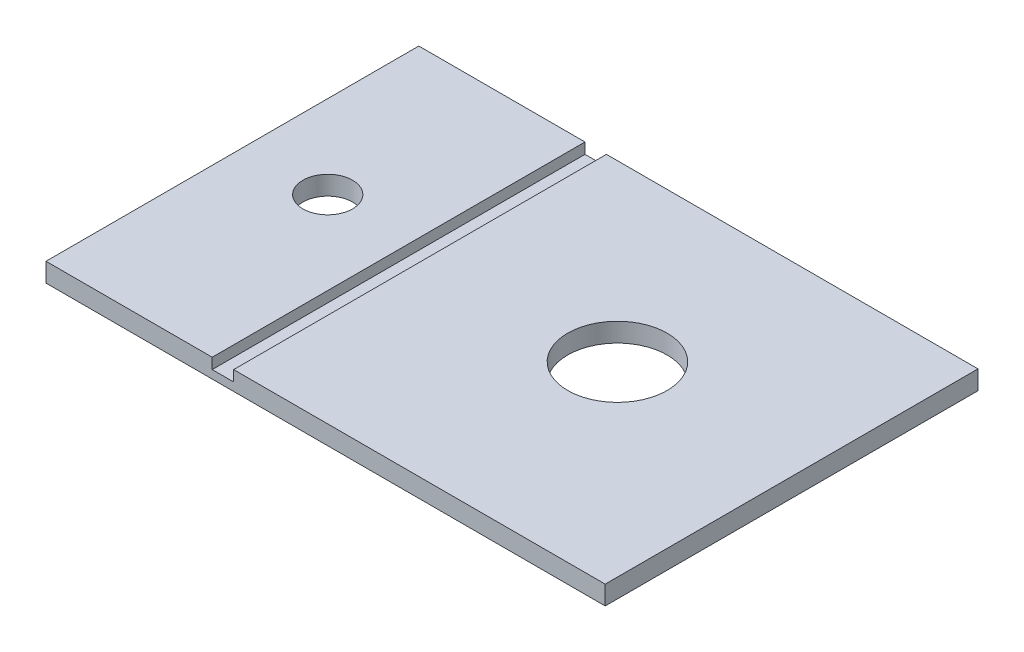
ISO-10303-21;
HEADER;
FILE_DESCRIPTION(('STEP AP214'),'2;1');
FILE_NAME('part.step','',(''),(''),'','','');
FILE_SCHEMA(('AUTOMOTIVE_DESIGN { 1 0 10303 214 1 1 1 1 }'));
ENDSEC;
DATA;
#1=APPLICATION_CONTEXT('core data for automotive mechanical design processes');
#2=APPLICATION_PROTOCOL_DEFINITION('international standard','automotive_design',2000,#1);
#3=PRODUCT_CONTEXT('',#1,'mechanical');
#4=PRODUCT('Part','Part','',(#3));
#5=PRODUCT_RELATED_PRODUCT_CATEGORY('part','',(#4));
#6=PRODUCT_DEFINITION_FORMATION('','',#4);
#7=PRODUCT_DEFINITION_CONTEXT('part definition',#1,'design');
#8=PRODUCT_DEFINITION('design','',#6,#7);
#9=PRODUCT_DEFINITION_SHAPE('','',#8);
#10=(LENGTH_UNIT() NAMED_UNIT(*) SI_UNIT(.MILLI.,.METRE.));
#11=(NAMED_UNIT(*) PLANE_ANGLE_UNIT() SI_UNIT($,.RADIAN.));
#12=(NAMED_UNIT(*) SI_UNIT($,.STERADIAN.) SOLID_ANGLE_UNIT());
#13=UNCERTAINTY_MEASURE_WITH_UNIT(LENGTH_MEASURE(1.E-05),#10,'distance_accuracy_value','');
#14=(GEOMETRIC_REPRESENTATION_CONTEXT(3) GLOBAL_UNCERTAINTY_ASSIGNED_CONTEXT((#13)) GLOBAL_UNIT_ASSIGNED_CONTEXT((#10,
#11,#12)) REPRESENTATION_CONTEXT('',''));
#15=CARTESIAN_POINT('',(0.,0.,0.));
#16=DIRECTION('',(0.,0.,1.));
#17=DIRECTION('',(1.,0.,0.));
#18=AXIS2_PLACEMENT_3D('',#15,#16,#17);
#19=CARTESIAN_POINT('',(0.,60.313864628821,750.258328629244));
#20=DIRECTION('',(0.,-1.,0.));
#21=DIRECTION('',(1.,0.,0.));
#22=AXIS2_PLACEMENT_3D('',#19,#20,#21);
#23=PLANE('',#22);
#24=CARTESIAN_POINT('',(-150.,60.3138646288209,140.161341077563));
#25=DIRECTION('',(0.,1.,0.));
#26=DIRECTION('',(-1.,0.,0.));
#27=AXIS2_PLACEMENT_3D('',#24,#25,#26);
#28=CIRCLE('',#27,40.);
#29=CARTESIAN_POINT('',(-190.,60.3138646288209,140.161341077563));
#30=VERTEX_POINT('',#29);
#31=EDGE_CURVE('E206',#30,#30,#28,.T.);
#32=ORIENTED_EDGE('',*,*,#31,.F.);
#33=EDGE_LOOP('',(#32));
#34=FACE_BOUND('',#33,.T.);
#35=DIRECTION('',(-1.,0.,0.));
#36=VECTOR('',#35,1.);
#37=CARTESIAN_POINT('',(0.,60.313864628821,0.));
#38=LINE('',#37,#36);
#39=CARTESIAN_POINT('',(0.,60.313864628821,0.));
#40=VERTEX_POINT('',#39);
#41=CARTESIAN_POINT('',(-299.,60.3138646288209,0.));
#42=VERTEX_POINT('',#41);
#43=EDGE_CURVE('E143',#40,#42,#38,.T.);
#44=ORIENTED_EDGE('',*,*,#43,.T.);
#45=DIRECTION('',(0.,0.,-1.));
#46=VECTOR('',#45,1.);
#47=CARTESIAN_POINT('',(-299.,60.3138646288209,0.));
#48=LINE('',#47,#46);
#49=CARTESIAN_POINT('',(-299.,60.3138646288209,300.));
#50=VERTEX_POINT('',#49);
#51=EDGE_CURVE('E101',#50,#42,#48,.T.);
#52=ORIENTED_EDGE('',*,*,#51,.F.);
#53=DIRECTION('',(-1.,0.,0.));
#54=VECTOR('',#53,1.);
#55=CARTESIAN_POINT('',(0.,60.313864628821,300.));
#56=LINE('',#55,#54);
#57=CARTESIAN_POINT('',(0.,60.313864628821,300.));
#58=VERTEX_POINT('',#57);
#59=EDGE_CURVE('E137',#58,#50,#56,.T.);
#60=ORIENTED_EDGE('',*,*,#59,.F.);
#61=DIRECTION('',(0.,0.,-1.));
#62=VECTOR('',#61,1.);
#63=CARTESIAN_POINT('',(0.,60.313864628821,750.258328629244));
#64=LINE('',#63,#62);
#65=EDGE_CURVE('E136',#58,#40,#64,.T.);
#66=ORIENTED_EDGE('',*,*,#65,.T.);
#67=EDGE_LOOP('',(#44,#52,#60,#66));
#68=FACE_BOUND('',#67,.T.);
#69=ADVANCED_FACE('F32',(#34,#68),#23,.F.);
#70=CARTESIAN_POINT('',(0.,45.063864628821,750.258328629244));
#71=DIRECTION('',(-1.,0.,0.));
#72=DIRECTION('',(0.,0.,1.));
#73=AXIS2_PLACEMENT_3D('',#70,#71,#72);
#74=PLANE('',#73);
#75=DIRECTION('',(0.,1.,0.));
#76=VECTOR('',#75,1.);
#77=CARTESIAN_POINT('',(0.,45.0638646288209,300.));
#78=LINE('',#77,#76);
#79=CARTESIAN_POINT('',(0.,45.063864628821,300.));
#80=VERTEX_POINT('',#79);
#81=EDGE_CURVE('E40',#80,#58,#78,.T.);
#82=ORIENTED_EDGE('',*,*,#81,.F.);
#83=DIRECTION('',(0.,0.,-1.));
#84=VECTOR('',#83,1.);
#85=CARTESIAN_POINT('',(0.,45.063864628821,750.258328629244));
#86=LINE('',#85,#84);
#87=CARTESIAN_POINT('',(0.,45.063864628821,0.));
#88=VERTEX_POINT('',#87);
#89=EDGE_CURVE('E151',#80,#88,#86,.T.);
#90=ORIENTED_EDGE('',*,*,#89,.T.);
#91=DIRECTION('',(0.,1.,0.));
#92=VECTOR('',#91,1.);
#93=CARTESIAN_POINT('',(0.,45.063864628821,0.));
#94=LINE('',#93,#92);
#95=EDGE_CURVE('E128',#88,#40,#94,.T.);
#96=ORIENTED_EDGE('',*,*,#95,.T.);
#97=ORIENTED_EDGE('',*,*,#65,.F.);
#98=EDGE_LOOP('',(#82,#90,#96,#97));
#99=FACE_BOUND('',#98,.T.);
#100=ADVANCED_FACE('F34',(#99),#74,.F.);
#101=CARTESIAN_POINT('',(-383.125,60.3138646288209,140.161341077563));
#102=DIRECTION('',(0.,1.,0.));
#103=DIRECTION('',(-1.,0.,0.));
#104=AXIS2_PLACEMENT_3D('',#101,#102,#103);
#105=CIRCLE('',#104,20.);
#106=CARTESIAN_POINT('',(-403.125,60.3138646288209,140.161341077563));
#107=VERTEX_POINT('',#106);
#108=EDGE_CURVE('E201',#107,#107,#105,.T.);
#109=ORIENTED_EDGE('',*,*,#108,.F.);
#110=EDGE_LOOP('',(#109));
#111=FACE_BOUND('',#110,.T.);
#112=CARTESIAN_POINT('',(-316.25,60.3138646288209,300.));
#113=VERTEX_POINT('',#112);
#114=CARTESIAN_POINT('',(-450.,60.3138646288209,300.));
#115=VERTEX_POINT('',#114);
#116=EDGE_CURVE('E135',#113,#115,#56,.T.);
#117=ORIENTED_EDGE('',*,*,#116,.F.);
#118=DIRECTION('',(0.,0.,1.));
#119=VECTOR('',#118,1.);
#120=CARTESIAN_POINT('',(-316.25,60.3138646288209,0.));
#121=LINE('',#120,#119);
#122=CARTESIAN_POINT('',(-316.25,60.3138646288209,0.));
#123=VERTEX_POINT('',#122);
#124=EDGE_CURVE('E114',#123,#113,#121,.T.);
#125=ORIENTED_EDGE('',*,*,#124,.F.);
#126=CARTESIAN_POINT('',(-450.,60.3138646288209,0.));
#127=VERTEX_POINT('',#126);
#128=EDGE_CURVE('E142',#123,#127,#38,.T.);
#129=ORIENTED_EDGE('',*,*,#128,.T.);
#130=DIRECTION('',(0.,0.,-1.));
#131=VECTOR('',#130,1.);
#132=CARTESIAN_POINT('',(-450.,60.3138646288209,750.258328629244));
#133=LINE('',#132,#131);
#134=EDGE_CURVE('E155',#115,#127,#133,.T.);
#135=ORIENTED_EDGE('',*,*,#134,.F.);
#136=EDGE_LOOP('',(#117,#125,#129,#135));
#137=FACE_BOUND('',#136,.T.);
#138=ADVANCED_FACE('F174',(#111,#137),#23,.F.);
#139=CARTESIAN_POINT('',(-450.,45.0638646288209,750.258328629244));
#140=DIRECTION('',(1.,0.,0.));
#141=DIRECTION('',(0.,1.,0.));
#142=AXIS2_PLACEMENT_3D('',#139,#140,#141);
#143=PLANE('',#142);
#144=DIRECTION('',(0.,-1.,0.));
#145=VECTOR('',#144,1.);
#146=CARTESIAN_POINT('',(-450.,45.0638646288208,300.));
#147=LINE('',#146,#145);
#148=CARTESIAN_POINT('',(-450.,45.0638646288209,300.));
#149=VERTEX_POINT('',#148);
#150=EDGE_CURVE('E133',#115,#149,#147,.T.);
#151=ORIENTED_EDGE('',*,*,#150,.F.);
#152=ORIENTED_EDGE('',*,*,#134,.T.);
#153=DIRECTION('',(0.,-1.,0.));
#154=VECTOR('',#153,1.);
#155=CARTESIAN_POINT('',(-450.,45.0638646288209,0.));
#156=LINE('',#155,#154);
#157=CARTESIAN_POINT('',(-450.,45.0638646288209,0.));
#158=VERTEX_POINT('',#157);
#159=EDGE_CURVE('E145',#127,#158,#156,.T.);
#160=ORIENTED_EDGE('',*,*,#159,.T.);
#161=DIRECTION('',(0.,0.,-1.));
#162=VECTOR('',#161,1.);
#163=CARTESIAN_POINT('',(-450.,45.0638646288209,750.258328629244));
#164=LINE('',#163,#162);
#165=EDGE_CURVE('E153',#149,#158,#164,.T.);
#166=ORIENTED_EDGE('',*,*,#165,.F.);
#167=EDGE_LOOP('',(#151,#152,#160,#166));
#168=FACE_BOUND('',#167,.T.);
#169=ADVANCED_FACE('F170',(#168),#143,.F.);
#170=CARTESIAN_POINT('',(0.,45.063864628821,750.258328629244));
#171=DIRECTION('',(0.,1.,0.));
#172=DIRECTION('',(-1.,0.,0.));
#173=AXIS2_PLACEMENT_3D('',#170,#171,#172);
#174=PLANE('',#173);
#175=CARTESIAN_POINT('',(-150.,45.0638646288209,140.161341077563));
#176=DIRECTION('',(0.,1.,0.));
#177=DIRECTION('',(-1.,0.,0.));
#178=AXIS2_PLACEMENT_3D('',#175,#176,#177);
#179=CIRCLE('',#178,40.);
#180=CARTESIAN_POINT('',(-190.,45.0638646288209,140.161341077563));
#181=VERTEX_POINT('',#180);
#182=EDGE_CURVE('E124',#181,#181,#179,.F.);
#183=ORIENTED_EDGE('',*,*,#182,.F.);
#184=EDGE_LOOP('',(#183));
#185=FACE_BOUND('',#184,.T.);
#186=CARTESIAN_POINT('',(-383.125,45.0638646288209,140.161341077563));
#187=DIRECTION('',(0.,1.,0.));
#188=DIRECTION('',(-1.,0.,0.));
#189=AXIS2_PLACEMENT_3D('',#186,#187,#188);
#190=CIRCLE('',#189,20.);
#191=CARTESIAN_POINT('',(-403.125,45.0638646288209,140.161341077563));
#192=VERTEX_POINT('',#191);
#193=EDGE_CURVE('E203',#192,#192,#190,.F.);
#194=ORIENTED_EDGE('',*,*,#193,.F.);
#195=EDGE_LOOP('',(#194));
#196=FACE_BOUND('',#195,.T.);
#197=DIRECTION('',(1.,0.,0.));
#198=VECTOR('',#197,1.);
#199=CARTESIAN_POINT('',(0.,45.063864628821,300.));
#200=LINE('',#199,#198);
#201=EDGE_CURVE('E11',#149,#80,#200,.T.);
#202=ORIENTED_EDGE('',*,*,#201,.F.);
#203=ORIENTED_EDGE('',*,*,#165,.T.);
#204=DIRECTION('',(1.,0.,0.));
#205=VECTOR('',#204,1.);
#206=CARTESIAN_POINT('',(0.,45.063864628821,0.));
#207=LINE('',#206,#205);
#208=EDGE_CURVE('E148',#158,#88,#207,.T.);
#209=ORIENTED_EDGE('',*,*,#208,.T.);
#210=ORIENTED_EDGE('',*,*,#89,.F.);
#211=EDGE_LOOP('',(#202,#203,#209,#210));
#212=FACE_BOUND('',#211,.T.);
#213=ADVANCED_FACE('F165',(#185,#196,#212),#174,.F.);
#214=CARTESIAN_POINT('',(0.,0.,0.));
#215=DIRECTION('',(0.,0.,1.));
#216=DIRECTION('',(1.,0.,0.));
#217=AXIS2_PLACEMENT_3D('',#214,#215,#216);
#218=PLANE('',#217);
#219=DIRECTION('',(-1.,0.,0.));
#220=VECTOR('',#219,1.);
#221=CARTESIAN_POINT('',(-299.,51.6888646288209,0.));
#222=LINE('',#221,#220);
#223=CARTESIAN_POINT('',(-299.,51.6888646288209,0.));
#224=VERTEX_POINT('',#223);
#225=CARTESIAN_POINT('',(-316.25,51.6888646288209,0.));
#226=VERTEX_POINT('',#225);
#227=EDGE_CURVE('E110',#224,#226,#222,.T.);
#228=ORIENTED_EDGE('',*,*,#227,.F.);
#229=DIRECTION('',(0.,1.,0.));
#230=VECTOR('',#229,1.);
#231=CARTESIAN_POINT('',(-299.,51.6888646288209,0.));
#232=LINE('',#231,#230);
#233=EDGE_CURVE('E96',#224,#42,#232,.T.);
#234=ORIENTED_EDGE('',*,*,#233,.T.);
#235=ORIENTED_EDGE('',*,*,#43,.F.);
#236=ORIENTED_EDGE('',*,*,#95,.F.);
#237=ORIENTED_EDGE('',*,*,#208,.F.);
#238=ORIENTED_EDGE('',*,*,#159,.F.);
#239=ORIENTED_EDGE('',*,*,#128,.F.);
#240=DIRECTION('',(0.,1.,0.));
#241=VECTOR('',#240,1.);
#242=CARTESIAN_POINT('',(-316.25,51.6888646288209,0.));
#243=LINE('',#242,#241);
#244=EDGE_CURVE('E106',#226,#123,#243,.T.);
#245=ORIENTED_EDGE('',*,*,#244,.F.);
#246=EDGE_LOOP('',(#228,#234,#235,#236,#237,#238,#239,#245));
#247=FACE_BOUND('',#246,.T.);
#248=ADVANCED_FACE('F116',(#247),#218,.F.);
#249=CARTESIAN_POINT('',(-465.25,185.313864628821,300.));
#250=DIRECTION('',(0.,0.,1.));
#251=DIRECTION('',(0.,1.,0.));
#252=AXIS2_PLACEMENT_3D('',#249,#250,#251);
#253=PLANE('',#252);
#254=DIRECTION('',(0.,1.,0.));
#255=VECTOR('',#254,1.);
#256=CARTESIAN_POINT('',(-299.,51.6888646288209,300.));
#257=LINE('',#256,#255);
#258=CARTESIAN_POINT('',(-299.,51.6888646288209,300.));
#259=VERTEX_POINT('',#258);
#260=EDGE_CURVE('E126',#259,#50,#257,.T.);
#261=ORIENTED_EDGE('',*,*,#260,.F.);
#262=DIRECTION('',(1.,0.,0.));
#263=VECTOR('',#262,1.);
#264=CARTESIAN_POINT('',(-299.,51.6888646288209,300.));
#265=LINE('',#264,#263);
#266=CARTESIAN_POINT('',(-316.25,51.6888646288209,300.));
#267=VERTEX_POINT('',#266);
#268=EDGE_CURVE('E107',#267,#259,#265,.T.);
#269=ORIENTED_EDGE('',*,*,#268,.F.);
#270=DIRECTION('',(0.,1.,0.));
#271=VECTOR('',#270,1.);
#272=CARTESIAN_POINT('',(-316.25,51.6888646288209,300.));
#273=LINE('',#272,#271);
#274=EDGE_CURVE('E129',#267,#113,#273,.T.);
#275=ORIENTED_EDGE('',*,*,#274,.T.);
#276=ORIENTED_EDGE('',*,*,#116,.T.);
#277=ORIENTED_EDGE('',*,*,#150,.T.);
#278=ORIENTED_EDGE('',*,*,#201,.T.);
#279=ORIENTED_EDGE('',*,*,#81,.T.);
#280=ORIENTED_EDGE('',*,*,#59,.T.);
#281=EDGE_LOOP('',(#261,#269,#275,#276,#277,#278,#279,#280));
#282=FACE_BOUND('',#281,.T.);
#283=ADVANCED_FACE('F178',(#282),#253,.T.);
#284=CARTESIAN_POINT('',(-299.,51.6888646288209,0.));
#285=DIRECTION('',(1.,0.,0.));
#286=DIRECTION('',(0.,0.,-1.));
#287=AXIS2_PLACEMENT_3D('',#284,#285,#286);
#288=PLANE('',#287);
#289=ORIENTED_EDGE('',*,*,#51,.T.);
#290=ORIENTED_EDGE('',*,*,#233,.F.);
#291=DIRECTION('',(0.,0.,-1.));
#292=VECTOR('',#291,1.);
#293=CARTESIAN_POINT('',(-299.,51.6888646288209,0.));
#294=LINE('',#293,#292);
#295=EDGE_CURVE('E99',#259,#224,#294,.T.);
#296=ORIENTED_EDGE('',*,*,#295,.F.);
#297=ORIENTED_EDGE('',*,*,#260,.T.);
#298=EDGE_LOOP('',(#289,#290,#296,#297));
#299=FACE_BOUND('',#298,.T.);
#300=ADVANCED_FACE('F98',(#299),#288,.F.);
#301=CARTESIAN_POINT('',(-316.25,51.6888646288209,0.));
#302=DIRECTION('',(-1.,0.,0.));
#303=DIRECTION('',(0.,0.,1.));
#304=AXIS2_PLACEMENT_3D('',#301,#302,#303);
#305=PLANE('',#304);
#306=ORIENTED_EDGE('',*,*,#124,.T.);
#307=ORIENTED_EDGE('',*,*,#274,.F.);
#308=DIRECTION('',(0.,0.,1.));
#309=VECTOR('',#308,1.);
#310=CARTESIAN_POINT('',(-316.25,51.6888646288209,0.));
#311=LINE('',#310,#309);
#312=EDGE_CURVE('E47',#226,#267,#311,.T.);
#313=ORIENTED_EDGE('',*,*,#312,.F.);
#314=ORIENTED_EDGE('',*,*,#244,.T.);
#315=EDGE_LOOP('',(#306,#307,#313,#314));
#316=FACE_BOUND('',#315,.T.);
#317=ADVANCED_FACE('F177',(#316),#305,.F.);
#318=CARTESIAN_POINT('',(0.,51.688864628821,0.));
#319=DIRECTION('',(0.,-1.,0.));
#320=DIRECTION('',(1.,0.,0.));
#321=AXIS2_PLACEMENT_3D('',#318,#319,#320);
#322=PLANE('',#321);
#323=ORIENTED_EDGE('',*,*,#295,.T.);
#324=ORIENTED_EDGE('',*,*,#227,.T.);
#325=ORIENTED_EDGE('',*,*,#312,.T.);
#326=ORIENTED_EDGE('',*,*,#268,.T.);
#327=EDGE_LOOP('',(#323,#324,#325,#326));
#328=FACE_BOUND('',#327,.T.);
#329=ADVANCED_FACE('F109',(#328),#322,.F.);
#330=CARTESIAN_POINT('',(-383.125,45.0628646288208,140.161341077563));
#331=DIRECTION('',(0.,1.,0.));
#332=DIRECTION('',(-1.,0.,0.));
#333=AXIS2_PLACEMENT_3D('',#330,#331,#332);
#334=CYLINDRICAL_SURFACE('',#333,20.);
#335=ORIENTED_EDGE('',*,*,#108,.T.);
#336=EDGE_LOOP('',(#335));
#337=FACE_BOUND('',#336,.T.);
#338=ORIENTED_EDGE('',*,*,#193,.T.);
#339=EDGE_LOOP('',(#338));
#340=FACE_BOUND('',#339,.T.);
#341=ADVANCED_FACE('F215',(#337,#340),#334,.F.);
#342=CARTESIAN_POINT('',(-150.,45.0628646288209,140.161341077563));
#343=DIRECTION('',(0.,1.,0.));
#344=DIRECTION('',(-1.,0.,0.));
#345=AXIS2_PLACEMENT_3D('',#342,#343,#344);
#346=CYLINDRICAL_SURFACE('',#345,40.);
#347=ORIENTED_EDGE('',*,*,#31,.T.);
#348=EDGE_LOOP('',(#347));
#349=FACE_BOUND('',#348,.T.);
#350=ORIENTED_EDGE('',*,*,#182,.T.);
#351=EDGE_LOOP('',(#350));
#352=FACE_BOUND('',#351,.T.);
#353=ADVANCED_FACE('F212',(#349,#352),#346,.F.);
#354=CLOSED_SHELL('',(#69,#100,#138,#169,#213,#248,#283,#300,#317,#329,#341,#353));
#355=MANIFOLD_SOLID_BREP('B2',#354);
#356=ADVANCED_BREP_SHAPE_REPRESENTATION('',(#18,#355),#14);
#357=SHAPE_DEFINITION_REPRESENTATION(#9,#356);
ENDSEC;
END-ISO-10303-21;
